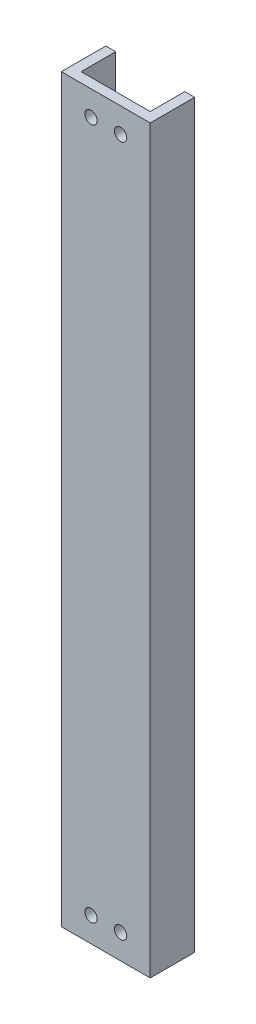
ISO-10303-21;
HEADER;
FILE_DESCRIPTION(('STEP AP214'),'2;1');
FILE_NAME('part.step','',(''),(''),'','','');
FILE_SCHEMA(('AUTOMOTIVE_DESIGN { 1 0 10303 214 1 1 1 1 }'));
ENDSEC;
DATA;
#1=APPLICATION_CONTEXT('core data for automotive mechanical design processes');
#2=APPLICATION_PROTOCOL_DEFINITION('international standard','automotive_design',2000,#1);
#3=PRODUCT_CONTEXT('',#1,'mechanical');
#4=PRODUCT('Part','Part','',(#3));
#5=PRODUCT_RELATED_PRODUCT_CATEGORY('part','',(#4));
#6=PRODUCT_DEFINITION_FORMATION('','',#4);
#7=PRODUCT_DEFINITION_CONTEXT('part definition',#1,'design');
#8=PRODUCT_DEFINITION('design','',#6,#7);
#9=PRODUCT_DEFINITION_SHAPE('','',#8);
#10=(LENGTH_UNIT() NAMED_UNIT(*) SI_UNIT(.MILLI.,.METRE.));
#11=(NAMED_UNIT(*) PLANE_ANGLE_UNIT() SI_UNIT($,.RADIAN.));
#12=(NAMED_UNIT(*) SI_UNIT($,.STERADIAN.) SOLID_ANGLE_UNIT());
#13=UNCERTAINTY_MEASURE_WITH_UNIT(LENGTH_MEASURE(1.E-05),#10,'distance_accuracy_value','');
#14=(GEOMETRIC_REPRESENTATION_CONTEXT(3) GLOBAL_UNCERTAINTY_ASSIGNED_CONTEXT((#13)) GLOBAL_UNIT_ASSIGNED_CONTEXT((#10,
#11,#12)) REPRESENTATION_CONTEXT('',''));
#15=CARTESIAN_POINT('',(0.,0.,0.));
#16=DIRECTION('',(0.,0.,1.));
#17=DIRECTION('',(1.,0.,0.));
#18=AXIS2_PLACEMENT_3D('',#15,#16,#17);
#19=CARTESIAN_POINT('',(9.,150.,-4.5));
#20=DIRECTION('',(-1.,0.,0.));
#21=DIRECTION('',(0.,0.,1.));
#22=AXIS2_PLACEMENT_3D('',#19,#20,#21);
#23=PLANE('',#22);
#24=DIRECTION('',(0.,0.,-1.));
#25=VECTOR('',#24,1.);
#26=CARTESIAN_POINT('',(9.,0.,-4.5));
#27=LINE('',#26,#25);
#28=CARTESIAN_POINT('',(9.,0.,4.5));
#29=VERTEX_POINT('',#28);
#30=CARTESIAN_POINT('',(9.,0.,-4.5));
#31=VERTEX_POINT('',#30);
#32=EDGE_CURVE('E135',#29,#31,#27,.T.);
#33=ORIENTED_EDGE('',*,*,#32,.T.);
#34=DIRECTION('',(0.,-1.,0.));
#35=VECTOR('',#34,1.);
#36=CARTESIAN_POINT('',(9.,150.,-4.5));
#37=LINE('',#36,#35);
#38=CARTESIAN_POINT('',(9.,150.,-4.5));
#39=VERTEX_POINT('',#38);
#40=EDGE_CURVE('E11',#39,#31,#37,.T.);
#41=ORIENTED_EDGE('',*,*,#40,.F.);
#42=DIRECTION('',(0.,0.,-1.));
#43=VECTOR('',#42,1.);
#44=CARTESIAN_POINT('',(9.,150.,-4.5));
#45=LINE('',#44,#43);
#46=CARTESIAN_POINT('',(9.,150.,4.5));
#47=VERTEX_POINT('',#46);
#48=EDGE_CURVE('E149',#47,#39,#45,.T.);
#49=ORIENTED_EDGE('',*,*,#48,.F.);
#50=DIRECTION('',(0.,-1.,0.));
#51=VECTOR('',#50,1.);
#52=CARTESIAN_POINT('',(9.,150.,4.5));
#53=LINE('',#52,#51);
#54=EDGE_CURVE('E131',#47,#29,#53,.T.);
#55=ORIENTED_EDGE('',*,*,#54,.T.);
#56=EDGE_LOOP('',(#33,#41,#49,#55));
#57=FACE_BOUND('',#56,.T.);
#58=ADVANCED_FACE('F37',(#57),#23,.F.);
#59=CARTESIAN_POINT('',(9.,150.,-4.5));
#60=DIRECTION('',(0.,0.,1.));
#61=DIRECTION('',(1.,0.,0.));
#62=AXIS2_PLACEMENT_3D('',#59,#60,#61);
#63=PLANE('',#62);
#64=DIRECTION('',(-1.,0.,0.));
#65=VECTOR('',#64,1.);
#66=CARTESIAN_POINT('',(9.,0.,-4.5));
#67=LINE('',#66,#65);
#68=CARTESIAN_POINT('',(7.,0.,-4.5));
#69=VERTEX_POINT('',#68);
#70=EDGE_CURVE('E138',#31,#69,#67,.T.);
#71=ORIENTED_EDGE('',*,*,#70,.T.);
#72=DIRECTION('',(0.,-1.,0.));
#73=VECTOR('',#72,1.);
#74=CARTESIAN_POINT('',(7.,150.,-4.5));
#75=LINE('',#74,#73);
#76=CARTESIAN_POINT('',(7.,150.,-4.5));
#77=VERTEX_POINT('',#76);
#78=EDGE_CURVE('E46',#77,#69,#75,.T.);
#79=ORIENTED_EDGE('',*,*,#78,.F.);
#80=DIRECTION('',(-1.,0.,0.));
#81=VECTOR('',#80,1.);
#82=CARTESIAN_POINT('',(9.,150.,-4.5));
#83=LINE('',#82,#81);
#84=EDGE_CURVE('E98',#39,#77,#83,.T.);
#85=ORIENTED_EDGE('',*,*,#84,.F.);
#86=ORIENTED_EDGE('',*,*,#40,.T.);
#87=EDGE_LOOP('',(#71,#79,#85,#86));
#88=FACE_BOUND('',#87,.T.);
#89=ADVANCED_FACE('F190',(#88),#63,.F.);
#90=CARTESIAN_POINT('',(7.,150.,-4.5));
#91=DIRECTION('',(1.,0.,0.));
#92=DIRECTION('',(0.,0.,-1.));
#93=AXIS2_PLACEMENT_3D('',#90,#91,#92);
#94=PLANE('',#93);
#95=DIRECTION('',(0.,0.,1.));
#96=VECTOR('',#95,1.);
#97=CARTESIAN_POINT('',(7.,0.,-4.5));
#98=LINE('',#97,#96);
#99=CARTESIAN_POINT('',(7.,0.,2.5));
#100=VERTEX_POINT('',#99);
#101=EDGE_CURVE('E140',#69,#100,#98,.T.);
#102=ORIENTED_EDGE('',*,*,#101,.T.);
#103=DIRECTION('',(0.,-1.,0.));
#104=VECTOR('',#103,1.);
#105=CARTESIAN_POINT('',(7.,150.,2.5));
#106=LINE('',#105,#104);
#107=CARTESIAN_POINT('',(7.,150.,2.5));
#108=VERTEX_POINT('',#107);
#109=EDGE_CURVE('E156',#108,#100,#106,.T.);
#110=ORIENTED_EDGE('',*,*,#109,.F.);
#111=DIRECTION('',(0.,0.,1.));
#112=VECTOR('',#111,1.);
#113=CARTESIAN_POINT('',(7.,150.,-4.5));
#114=LINE('',#113,#112);
#115=EDGE_CURVE('E206',#77,#108,#114,.T.);
#116=ORIENTED_EDGE('',*,*,#115,.F.);
#117=ORIENTED_EDGE('',*,*,#78,.T.);
#118=EDGE_LOOP('',(#102,#110,#116,#117));
#119=FACE_BOUND('',#118,.T.);
#120=ADVANCED_FACE('F195',(#119),#94,.F.);
#121=CARTESIAN_POINT('',(-7.,150.,2.5));
#122=DIRECTION('',(0.,0.,1.));
#123=DIRECTION('',(1.,0.,0.));
#124=AXIS2_PLACEMENT_3D('',#121,#122,#123);
#125=PLANE('',#124);
#126=CARTESIAN_POINT('',(2.99999999999998,145.,2.5));
#127=DIRECTION('',(0.,0.,-1.));
#128=DIRECTION('',(1.,0.,0.));
#129=AXIS2_PLACEMENT_3D('',#126,#127,#128);
#130=CIRCLE('',#129,1.25);
#131=CARTESIAN_POINT('',(4.24999999999998,145.,2.5));
#132=VERTEX_POINT('',#131);
#133=EDGE_CURVE('E217',#132,#132,#130,.T.);
#134=ORIENTED_EDGE('',*,*,#133,.F.);
#135=EDGE_LOOP('',(#134));
#136=FACE_BOUND('',#135,.T.);
#137=CARTESIAN_POINT('',(-3.00000000000002,145.,2.5));
#138=DIRECTION('',(0.,0.,-1.));
#139=DIRECTION('',(1.,0.,0.));
#140=AXIS2_PLACEMENT_3D('',#137,#138,#139);
#141=CIRCLE('',#140,1.25);
#142=CARTESIAN_POINT('',(-1.75000000000002,145.,2.5));
#143=VERTEX_POINT('',#142);
#144=EDGE_CURVE('E219',#143,#143,#141,.T.);
#145=ORIENTED_EDGE('',*,*,#144,.F.);
#146=EDGE_LOOP('',(#145));
#147=FACE_BOUND('',#146,.T.);
#148=CARTESIAN_POINT('',(-3.00000000000002,5.,2.5));
#149=DIRECTION('',(0.,0.,-1.));
#150=DIRECTION('',(-1.,0.,0.));
#151=AXIS2_PLACEMENT_3D('',#148,#149,#150);
#152=CIRCLE('',#151,1.25);
#153=CARTESIAN_POINT('',(-4.25000000000002,5.,2.5));
#154=VERTEX_POINT('',#153);
#155=EDGE_CURVE('E216',#154,#154,#152,.T.);
#156=ORIENTED_EDGE('',*,*,#155,.F.);
#157=EDGE_LOOP('',(#156));
#158=FACE_BOUND('',#157,.T.);
#159=CARTESIAN_POINT('',(2.99999999999998,5.,2.5));
#160=DIRECTION('',(0.,0.,-1.));
#161=DIRECTION('',(-1.,0.,0.));
#162=AXIS2_PLACEMENT_3D('',#159,#160,#161);
#163=CIRCLE('',#162,1.25);
#164=CARTESIAN_POINT('',(1.74999999999998,5.,2.5));
#165=VERTEX_POINT('',#164);
#166=EDGE_CURVE('E165',#165,#165,#163,.T.);
#167=ORIENTED_EDGE('',*,*,#166,.F.);
#168=EDGE_LOOP('',(#167));
#169=FACE_BOUND('',#168,.T.);
#170=DIRECTION('',(-1.,0.,0.));
#171=VECTOR('',#170,1.);
#172=CARTESIAN_POINT('',(-7.,0.,2.5));
#173=LINE('',#172,#171);
#174=CARTESIAN_POINT('',(-7.,0.,2.5));
#175=VERTEX_POINT('',#174);
#176=EDGE_CURVE('E142',#100,#175,#173,.T.);
#177=ORIENTED_EDGE('',*,*,#176,.T.);
#178=DIRECTION('',(0.,-1.,0.));
#179=VECTOR('',#178,1.);
#180=CARTESIAN_POINT('',(-7.,150.,2.5));
#181=LINE('',#180,#179);
#182=CARTESIAN_POINT('',(-7.,150.,2.5));
#183=VERTEX_POINT('',#182);
#184=EDGE_CURVE('E153',#183,#175,#181,.T.);
#185=ORIENTED_EDGE('',*,*,#184,.F.);
#186=DIRECTION('',(-1.,0.,0.));
#187=VECTOR('',#186,1.);
#188=CARTESIAN_POINT('',(-7.,150.,2.5));
#189=LINE('',#188,#187);
#190=EDGE_CURVE('E208',#108,#183,#189,.T.);
#191=ORIENTED_EDGE('',*,*,#190,.F.);
#192=ORIENTED_EDGE('',*,*,#109,.T.);
#193=EDGE_LOOP('',(#177,#185,#191,#192));
#194=FACE_BOUND('',#193,.T.);
#195=ADVANCED_FACE('F227',(#136,#147,#158,#169,#194),#125,.F.);
#196=CARTESIAN_POINT('',(-7.,150.,-4.5));
#197=DIRECTION('',(-1.,0.,0.));
#198=DIRECTION('',(0.,0.,1.));
#199=AXIS2_PLACEMENT_3D('',#196,#197,#198);
#200=PLANE('',#199);
#201=DIRECTION('',(0.,0.,-1.));
#202=VECTOR('',#201,1.);
#203=CARTESIAN_POINT('',(-7.,0.,-4.5));
#204=LINE('',#203,#202);
#205=CARTESIAN_POINT('',(-7.,0.,-4.5));
#206=VERTEX_POINT('',#205);
#207=EDGE_CURVE('E144',#175,#206,#204,.T.);
#208=ORIENTED_EDGE('',*,*,#207,.T.);
#209=DIRECTION('',(0.,-1.,0.));
#210=VECTOR('',#209,1.);
#211=CARTESIAN_POINT('',(-7.,150.,-4.5));
#212=LINE('',#211,#210);
#213=CARTESIAN_POINT('',(-7.,150.,-4.5));
#214=VERTEX_POINT('',#213);
#215=EDGE_CURVE('E126',#214,#206,#212,.T.);
#216=ORIENTED_EDGE('',*,*,#215,.F.);
#217=DIRECTION('',(0.,0.,-1.));
#218=VECTOR('',#217,1.);
#219=CARTESIAN_POINT('',(-7.,150.,-4.5));
#220=LINE('',#219,#218);
#221=EDGE_CURVE('E117',#183,#214,#220,.T.);
#222=ORIENTED_EDGE('',*,*,#221,.F.);
#223=ORIENTED_EDGE('',*,*,#184,.T.);
#224=EDGE_LOOP('',(#208,#216,#222,#223));
#225=FACE_BOUND('',#224,.T.);
#226=ADVANCED_FACE('F230',(#225),#200,.F.);
#227=CARTESIAN_POINT('',(-9.,150.,-4.5));
#228=DIRECTION('',(0.,0.,1.));
#229=DIRECTION('',(1.,0.,0.));
#230=AXIS2_PLACEMENT_3D('',#227,#228,#229);
#231=PLANE('',#230);
#232=DIRECTION('',(-1.,0.,0.));
#233=VECTOR('',#232,1.);
#234=CARTESIAN_POINT('',(-9.,0.,-4.5));
#235=LINE('',#234,#233);
#236=CARTESIAN_POINT('',(-9.,0.,-4.5));
#237=VERTEX_POINT('',#236);
#238=EDGE_CURVE('E125',#206,#237,#235,.T.);
#239=ORIENTED_EDGE('',*,*,#238,.T.);
#240=DIRECTION('',(0.,-1.,0.));
#241=VECTOR('',#240,1.);
#242=CARTESIAN_POINT('',(-9.,150.,-4.5));
#243=LINE('',#242,#241);
#244=CARTESIAN_POINT('',(-9.,150.,-4.5));
#245=VERTEX_POINT('',#244);
#246=EDGE_CURVE('E122',#245,#237,#243,.T.);
#247=ORIENTED_EDGE('',*,*,#246,.F.);
#248=DIRECTION('',(-1.,0.,0.));
#249=VECTOR('',#248,1.);
#250=CARTESIAN_POINT('',(-9.,150.,-4.5));
#251=LINE('',#250,#249);
#252=EDGE_CURVE('E111',#214,#245,#251,.T.);
#253=ORIENTED_EDGE('',*,*,#252,.F.);
#254=ORIENTED_EDGE('',*,*,#215,.T.);
#255=EDGE_LOOP('',(#239,#247,#253,#254));
#256=FACE_BOUND('',#255,.T.);
#257=ADVANCED_FACE('F123',(#256),#231,.F.);
#258=CARTESIAN_POINT('',(-9.,150.,-4.5));
#259=DIRECTION('',(1.,0.,0.));
#260=DIRECTION('',(0.,0.,-1.));
#261=AXIS2_PLACEMENT_3D('',#258,#259,#260);
#262=PLANE('',#261);
#263=DIRECTION('',(0.,0.,1.));
#264=VECTOR('',#263,1.);
#265=CARTESIAN_POINT('',(-9.,0.,-4.5));
#266=LINE('',#265,#264);
#267=CARTESIAN_POINT('',(-9.,0.,4.5));
#268=VERTEX_POINT('',#267);
#269=EDGE_CURVE('E84',#237,#268,#266,.T.);
#270=ORIENTED_EDGE('',*,*,#269,.T.);
#271=DIRECTION('',(0.,-1.,0.));
#272=VECTOR('',#271,1.);
#273=CARTESIAN_POINT('',(-9.,150.,4.5));
#274=LINE('',#273,#272);
#275=CARTESIAN_POINT('',(-9.,150.,4.5));
#276=VERTEX_POINT('',#275);
#277=EDGE_CURVE('E127',#276,#268,#274,.T.);
#278=ORIENTED_EDGE('',*,*,#277,.F.);
#279=DIRECTION('',(0.,0.,1.));
#280=VECTOR('',#279,1.);
#281=CARTESIAN_POINT('',(-9.,150.,-4.5));
#282=LINE('',#281,#280);
#283=EDGE_CURVE('E115',#245,#276,#282,.T.);
#284=ORIENTED_EDGE('',*,*,#283,.F.);
#285=ORIENTED_EDGE('',*,*,#246,.T.);
#286=EDGE_LOOP('',(#270,#278,#284,#285));
#287=FACE_BOUND('',#286,.T.);
#288=ADVANCED_FACE('F129',(#287),#262,.F.);
#289=CARTESIAN_POINT('',(-9.,150.,4.5));
#290=DIRECTION('',(0.,0.,-1.));
#291=DIRECTION('',(-1.,0.,0.));
#292=AXIS2_PLACEMENT_3D('',#289,#290,#291);
#293=PLANE('',#292);
#294=CARTESIAN_POINT('',(2.99999999999998,145.,4.5));
#295=DIRECTION('',(0.,0.,-1.));
#296=DIRECTION('',(-1.,0.,0.));
#297=AXIS2_PLACEMENT_3D('',#294,#295,#296);
#298=CIRCLE('',#297,1.25);
#299=CARTESIAN_POINT('',(1.74999999999998,145.,4.5));
#300=VERTEX_POINT('',#299);
#301=EDGE_CURVE('E40',#300,#300,#298,.T.);
#302=ORIENTED_EDGE('',*,*,#301,.T.);
#303=EDGE_LOOP('',(#302));
#304=FACE_BOUND('',#303,.T.);
#305=CARTESIAN_POINT('',(-3.00000000000002,145.,4.5));
#306=DIRECTION('',(0.,0.,-1.));
#307=DIRECTION('',(-1.,0.,0.));
#308=AXIS2_PLACEMENT_3D('',#305,#306,#307);
#309=CIRCLE('',#308,1.25);
#310=CARTESIAN_POINT('',(-4.25000000000002,145.,4.5));
#311=VERTEX_POINT('',#310);
#312=EDGE_CURVE('E167',#311,#311,#309,.T.);
#313=ORIENTED_EDGE('',*,*,#312,.T.);
#314=EDGE_LOOP('',(#313));
#315=FACE_BOUND('',#314,.T.);
#316=CARTESIAN_POINT('',(-3.00000000000002,5.,4.5));
#317=DIRECTION('',(0.,0.,-1.));
#318=DIRECTION('',(-1.,0.,0.));
#319=AXIS2_PLACEMENT_3D('',#316,#317,#318);
#320=CIRCLE('',#319,1.25);
#321=CARTESIAN_POINT('',(-4.25000000000002,5.,4.5));
#322=VERTEX_POINT('',#321);
#323=EDGE_CURVE('E164',#322,#322,#320,.T.);
#324=ORIENTED_EDGE('',*,*,#323,.T.);
#325=EDGE_LOOP('',(#324));
#326=FACE_BOUND('',#325,.T.);
#327=CARTESIAN_POINT('',(2.99999999999998,5.,4.5));
#328=DIRECTION('',(0.,0.,-1.));
#329=DIRECTION('',(-1.,0.,0.));
#330=AXIS2_PLACEMENT_3D('',#327,#328,#329);
#331=CIRCLE('',#330,1.25);
#332=CARTESIAN_POINT('',(1.74999999999998,5.,4.5));
#333=VERTEX_POINT('',#332);
#334=EDGE_CURVE('E161',#333,#333,#331,.T.);
#335=ORIENTED_EDGE('',*,*,#334,.T.);
#336=EDGE_LOOP('',(#335));
#337=FACE_BOUND('',#336,.T.);
#338=DIRECTION('',(1.,0.,0.));
#339=VECTOR('',#338,1.);
#340=CARTESIAN_POINT('',(-9.,0.,4.5));
#341=LINE('',#340,#339);
#342=EDGE_CURVE('E90',#268,#29,#341,.T.);
#343=ORIENTED_EDGE('',*,*,#342,.T.);
#344=ORIENTED_EDGE('',*,*,#54,.F.);
#345=DIRECTION('',(1.,0.,0.));
#346=VECTOR('',#345,1.);
#347=CARTESIAN_POINT('',(-9.,150.,4.5));
#348=LINE('',#347,#346);
#349=EDGE_CURVE('E55',#276,#47,#348,.T.);
#350=ORIENTED_EDGE('',*,*,#349,.F.);
#351=ORIENTED_EDGE('',*,*,#277,.T.);
#352=EDGE_LOOP('',(#343,#344,#350,#351));
#353=FACE_BOUND('',#352,.T.);
#354=ADVANCED_FACE('F174',(#304,#315,#326,#337,#353),#293,.F.);
#355=CARTESIAN_POINT('',(0.,150.,0.));
#356=DIRECTION('',(0.,1.,0.));
#357=DIRECTION('',(0.,0.,1.));
#358=AXIS2_PLACEMENT_3D('',#355,#356,#357);
#359=PLANE('',#358);
#360=ORIENTED_EDGE('',*,*,#48,.T.);
#361=ORIENTED_EDGE('',*,*,#84,.T.);
#362=ORIENTED_EDGE('',*,*,#115,.T.);
#363=ORIENTED_EDGE('',*,*,#190,.T.);
#364=ORIENTED_EDGE('',*,*,#221,.T.);
#365=ORIENTED_EDGE('',*,*,#252,.T.);
#366=ORIENTED_EDGE('',*,*,#283,.T.);
#367=ORIENTED_EDGE('',*,*,#349,.T.);
#368=EDGE_LOOP('',(#360,#361,#362,#363,#364,#365,#366,#367));
#369=FACE_BOUND('',#368,.T.);
#370=ADVANCED_FACE('F113',(#369),#359,.T.);
#371=CARTESIAN_POINT('',(0.,0.,0.));
#372=DIRECTION('',(0.,1.,0.));
#373=DIRECTION('',(0.,0.,1.));
#374=AXIS2_PLACEMENT_3D('',#371,#372,#373);
#375=PLANE('',#374);
#376=ORIENTED_EDGE('',*,*,#32,.F.);
#377=ORIENTED_EDGE('',*,*,#342,.F.);
#378=ORIENTED_EDGE('',*,*,#269,.F.);
#379=ORIENTED_EDGE('',*,*,#238,.F.);
#380=ORIENTED_EDGE('',*,*,#207,.F.);
#381=ORIENTED_EDGE('',*,*,#176,.F.);
#382=ORIENTED_EDGE('',*,*,#101,.F.);
#383=ORIENTED_EDGE('',*,*,#70,.F.);
#384=EDGE_LOOP('',(#376,#377,#378,#379,#380,#381,#382,#383));
#385=FACE_BOUND('',#384,.T.);
#386=ADVANCED_FACE('F200',(#385),#375,.F.);
#387=CARTESIAN_POINT('',(2.99999999999998,5.,12.5));
#388=DIRECTION('',(0.,0.,-1.));
#389=DIRECTION('',(-1.,0.,0.));
#390=AXIS2_PLACEMENT_3D('',#387,#388,#389);
#391=CYLINDRICAL_SURFACE('',#390,1.25);
#392=ORIENTED_EDGE('',*,*,#166,.T.);
#393=EDGE_LOOP('',(#392));
#394=FACE_BOUND('',#393,.T.);
#395=ORIENTED_EDGE('',*,*,#334,.F.);
#396=EDGE_LOOP('',(#395));
#397=FACE_BOUND('',#396,.T.);
#398=ADVANCED_FACE('F278',(#394,#397),#391,.F.);
#399=CARTESIAN_POINT('',(-3.00000000000002,5.,12.5));
#400=DIRECTION('',(0.,0.,-1.));
#401=DIRECTION('',(-1.,0.,0.));
#402=AXIS2_PLACEMENT_3D('',#399,#400,#401);
#403=CYLINDRICAL_SURFACE('',#402,1.25);
#404=ORIENTED_EDGE('',*,*,#155,.T.);
#405=EDGE_LOOP('',(#404));
#406=FACE_BOUND('',#405,.T.);
#407=ORIENTED_EDGE('',*,*,#323,.F.);
#408=EDGE_LOOP('',(#407));
#409=FACE_BOUND('',#408,.T.);
#410=ADVANCED_FACE('F184',(#406,#409),#403,.F.);
#411=CARTESIAN_POINT('',(-3.00000000000002,145.,12.5));
#412=DIRECTION('',(0.,0.,-1.));
#413=DIRECTION('',(-1.,0.,0.));
#414=AXIS2_PLACEMENT_3D('',#411,#412,#413);
#415=CYLINDRICAL_SURFACE('',#414,1.25);
#416=ORIENTED_EDGE('',*,*,#144,.T.);
#417=EDGE_LOOP('',(#416));
#418=FACE_BOUND('',#417,.T.);
#419=ORIENTED_EDGE('',*,*,#312,.F.);
#420=EDGE_LOOP('',(#419));
#421=FACE_BOUND('',#420,.T.);
#422=ADVANCED_FACE('F178',(#418,#421),#415,.F.);
#423=CARTESIAN_POINT('',(2.99999999999998,145.,12.5));
#424=DIRECTION('',(0.,0.,-1.));
#425=DIRECTION('',(-1.,0.,0.));
#426=AXIS2_PLACEMENT_3D('',#423,#424,#425);
#427=CYLINDRICAL_SURFACE('',#426,1.25);
#428=ORIENTED_EDGE('',*,*,#133,.T.);
#429=EDGE_LOOP('',(#428));
#430=FACE_BOUND('',#429,.T.);
#431=ORIENTED_EDGE('',*,*,#301,.F.);
#432=EDGE_LOOP('',(#431));
#433=FACE_BOUND('',#432,.T.);
#434=ADVANCED_FACE('F176',(#430,#433),#427,.F.);
#435=CLOSED_SHELL('',(#58,#89,#120,#195,#226,#257,#288,#354,#370,#386,#398,#410,#422,#434));
#436=MANIFOLD_SOLID_BREP('B2',#435);
#437=ADVANCED_BREP_SHAPE_REPRESENTATION('',(#18,#436),#14);
#438=SHAPE_DEFINITION_REPRESENTATION(#9,#437);
ENDSEC;
END-ISO-10303-21;
